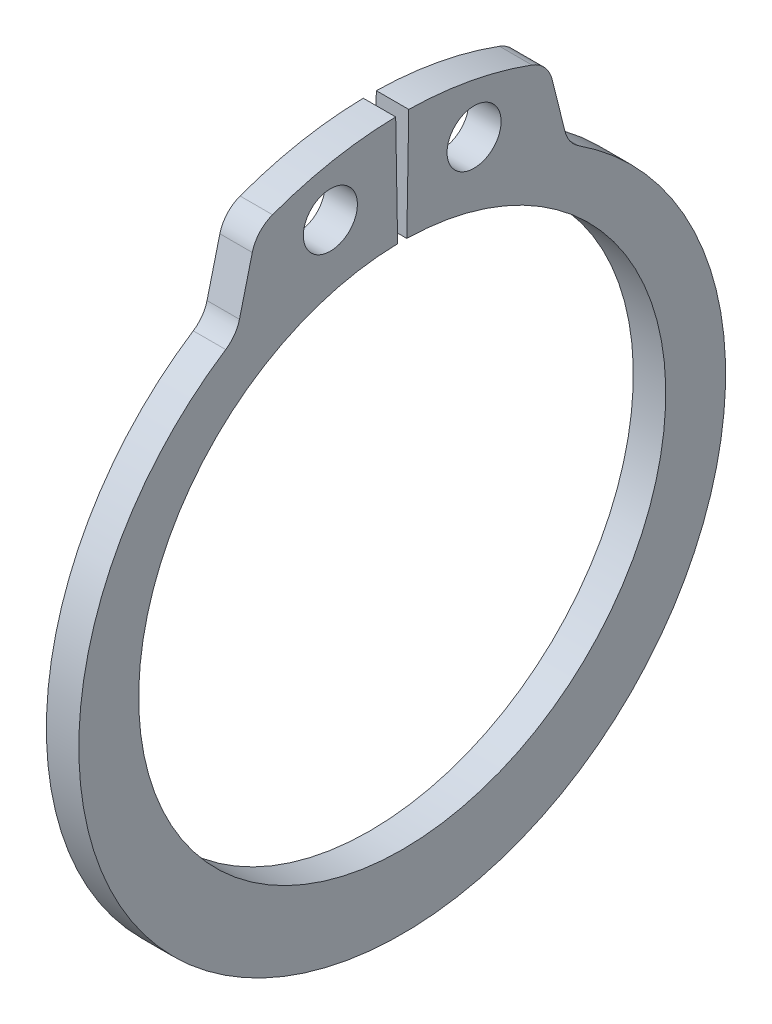
ISO-10303-21;
HEADER;
FILE_DESCRIPTION(('STEP AP214'),'2;1');
FILE_NAME('part.step','',(''),(''),'','','');
FILE_SCHEMA(('AUTOMOTIVE_DESIGN { 1 0 10303 214 1 1 1 1 }'));
ENDSEC;
DATA;
#1=APPLICATION_CONTEXT('core data for automotive mechanical design processes');
#2=APPLICATION_PROTOCOL_DEFINITION('international standard','automotive_design',2000,#1);
#3=PRODUCT_CONTEXT('',#1,'mechanical');
#4=PRODUCT('Part','Part','',(#3));
#5=PRODUCT_RELATED_PRODUCT_CATEGORY('part','',(#4));
#6=PRODUCT_DEFINITION_FORMATION('','',#4);
#7=PRODUCT_DEFINITION_CONTEXT('part definition',#1,'design');
#8=PRODUCT_DEFINITION('design','',#6,#7);
#9=PRODUCT_DEFINITION_SHAPE('','',#8);
#10=(LENGTH_UNIT() NAMED_UNIT(*) SI_UNIT(.MILLI.,.METRE.));
#11=(NAMED_UNIT(*) PLANE_ANGLE_UNIT() SI_UNIT($,.RADIAN.));
#12=(NAMED_UNIT(*) SI_UNIT($,.STERADIAN.) SOLID_ANGLE_UNIT());
#13=UNCERTAINTY_MEASURE_WITH_UNIT(LENGTH_MEASURE(1.E-05),#10,'distance_accuracy_value','');
#14=(GEOMETRIC_REPRESENTATION_CONTEXT(3) GLOBAL_UNCERTAINTY_ASSIGNED_CONTEXT((#13)) GLOBAL_UNIT_ASSIGNED_CONTEXT((#10,
#11,#12)) REPRESENTATION_CONTEXT('',''));
#15=CARTESIAN_POINT('',(0.,0.,0.));
#16=DIRECTION('',(0.,0.,1.));
#17=DIRECTION('',(1.,0.,0.));
#18=AXIS2_PLACEMENT_3D('',#15,#16,#17);
#19=CARTESIAN_POINT('',(0.6,10.5448233971455,7.18500975582168));
#20=DIRECTION('',(-1.,0.,0.));
#21=DIRECTION('',(0.,0.,1.));
#22=AXIS2_PLACEMENT_3D('',#19,#20,#21);
#23=CYLINDRICAL_SURFACE('',#22,1.2);
#24=CARTESIAN_POINT('',(-0.6,10.5448233971455,7.18500975582168));
#25=DIRECTION('',(1.,0.,0.));
#26=DIRECTION('',(0.,0.,-1.));
#27=AXIS2_PLACEMENT_3D('',#24,#25,#26);
#28=CIRCLE('',#27,1.2);
#29=CARTESIAN_POINT('',(-0.6,9.53932227271346,6.53005365899852));
#30=VERTEX_POINT('',#29);
#31=CARTESIAN_POINT('',(-0.6,10.2545171224259,6.02065488429048));
#32=VERTEX_POINT('',#31);
#33=EDGE_CURVE('E164',#30,#32,#28,.T.);
#34=ORIENTED_EDGE('',*,*,#33,.F.);
#35=DIRECTION('',(-1.,0.,0.));
#36=VECTOR('',#35,1.);
#37=CARTESIAN_POINT('',(0.6,9.53932227271346,6.53005365899852));
#38=LINE('',#37,#36);
#39=CARTESIAN_POINT('',(0.6,9.53932227271346,6.53005365899852));
#40=VERTEX_POINT('',#39);
#41=EDGE_CURVE('E11',#40,#30,#38,.T.);
#42=ORIENTED_EDGE('',*,*,#41,.F.);
#43=CARTESIAN_POINT('',(0.6,10.5448233971455,7.18500975582168));
#44=DIRECTION('',(1.,0.,0.));
#45=DIRECTION('',(0.,0.,-1.));
#46=AXIS2_PLACEMENT_3D('',#43,#44,#45);
#47=CIRCLE('',#46,1.2);
#48=CARTESIAN_POINT('',(0.6,10.2545171224259,6.02065488429048));
#49=VERTEX_POINT('',#48);
#50=EDGE_CURVE('E197',#40,#49,#47,.T.);
#51=ORIENTED_EDGE('',*,*,#50,.T.);
#52=DIRECTION('',(-1.,0.,0.));
#53=VECTOR('',#52,1.);
#54=CARTESIAN_POINT('',(0.6,10.2545171224259,6.02065488429048));
#55=LINE('',#54,#53);
#56=EDGE_CURVE('E46',#49,#32,#55,.T.);
#57=ORIENTED_EDGE('',*,*,#56,.T.);
#58=EDGE_LOOP('',(#34,#42,#51,#57));
#59=FACE_BOUND('',#58,.T.);
#60=ADVANCED_FACE('F43',(#59),#23,.F.);
#61=CARTESIAN_POINT('',(0.6,-0.485740977438435,0.));
#62=DIRECTION('',(-1.,0.,0.));
#63=DIRECTION('',(0.,0.,1.));
#64=AXIS2_PLACEMENT_3D('',#61,#62,#63);
#65=CYLINDRICAL_SURFACE('',#64,11.9642590225616);
#66=CARTESIAN_POINT('',(-0.6,-0.485740977438435,0.));
#67=DIRECTION('',(-1.,0.,0.));
#68=DIRECTION('',(0.,0.,1.));
#69=AXIS2_PLACEMENT_3D('',#66,#67,#68);
#70=CIRCLE('',#69,11.9642590225616);
#71=CARTESIAN_POINT('',(-0.6,9.53932227271346,-6.53005365899852));
#72=VERTEX_POINT('',#71);
#73=EDGE_CURVE('E195',#72,#30,#70,.T.);
#74=ORIENTED_EDGE('',*,*,#73,.F.);
#75=DIRECTION('',(-1.,0.,0.));
#76=VECTOR('',#75,1.);
#77=CARTESIAN_POINT('',(0.6,9.53932227271346,-6.53005365899852));
#78=LINE('',#77,#76);
#79=CARTESIAN_POINT('',(0.6,9.53932227271346,-6.53005365899852));
#80=VERTEX_POINT('',#79);
#81=EDGE_CURVE('E52',#80,#72,#78,.T.);
#82=ORIENTED_EDGE('',*,*,#81,.F.);
#83=CARTESIAN_POINT('',(0.6,-0.485740977438435,0.));
#84=DIRECTION('',(-1.,0.,0.));
#85=DIRECTION('',(0.,0.,1.));
#86=AXIS2_PLACEMENT_3D('',#83,#84,#85);
#87=CIRCLE('',#86,11.9642590225616);
#88=EDGE_CURVE('E154',#80,#40,#87,.T.);
#89=ORIENTED_EDGE('',*,*,#88,.T.);
#90=ORIENTED_EDGE('',*,*,#41,.T.);
#91=EDGE_LOOP('',(#74,#82,#89,#90));
#92=FACE_BOUND('',#91,.T.);
#93=ADVANCED_FACE('F217',(#92),#65,.T.);
#94=CARTESIAN_POINT('',(0.6,10.5448233971455,-7.18500975582168));
#95=DIRECTION('',(-1.,0.,0.));
#96=DIRECTION('',(0.,0.,1.));
#97=AXIS2_PLACEMENT_3D('',#94,#95,#96);
#98=CYLINDRICAL_SURFACE('',#97,1.2);
#99=CARTESIAN_POINT('',(-0.6,10.5448233971455,-7.18500975582168));
#100=DIRECTION('',(1.,0.,0.));
#101=DIRECTION('',(0.,0.,-1.));
#102=AXIS2_PLACEMENT_3D('',#99,#100,#101);
#103=CIRCLE('',#102,1.2);
#104=CARTESIAN_POINT('',(-0.6,10.2545171224259,-6.02065488429049));
#105=VERTEX_POINT('',#104);
#106=EDGE_CURVE('E141',#105,#72,#103,.T.);
#107=ORIENTED_EDGE('',*,*,#106,.F.);
#108=DIRECTION('',(-1.,0.,0.));
#109=VECTOR('',#108,1.);
#110=CARTESIAN_POINT('',(0.6,10.2545171224259,-6.02065488429049));
#111=LINE('',#110,#109);
#112=CARTESIAN_POINT('',(0.6,10.2545171224259,-6.02065488429049));
#113=VERTEX_POINT('',#112);
#114=EDGE_CURVE('E136',#113,#105,#111,.T.);
#115=ORIENTED_EDGE('',*,*,#114,.F.);
#116=CARTESIAN_POINT('',(0.6,10.5448233971455,-7.18500975582168));
#117=DIRECTION('',(1.,0.,0.));
#118=DIRECTION('',(0.,0.,-1.));
#119=AXIS2_PLACEMENT_3D('',#116,#117,#118);
#120=CIRCLE('',#119,1.2);
#121=EDGE_CURVE('E139',#113,#80,#120,.T.);
#122=ORIENTED_EDGE('',*,*,#121,.T.);
#123=ORIENTED_EDGE('',*,*,#81,.T.);
#124=EDGE_LOOP('',(#107,#115,#122,#123));
#125=FACE_BOUND('',#124,.T.);
#126=ADVANCED_FACE('F138',(#125),#98,.F.);
#127=CARTESIAN_POINT('',(0.6,12.1571172360104,-5.54628339776127));
#128=DIRECTION('',(0.,0.241921895599667,-0.970295726275997));
#129=DIRECTION('',(0.,0.970295726275997,0.241921895599667));
#130=AXIS2_PLACEMENT_3D('',#127,#128,#129);
#131=PLANE('',#130);
#132=DIRECTION('',(0.,-0.970295726275997,-0.241921895599667));
#133=VECTOR('',#132,1.);
#134=CARTESIAN_POINT('',(-0.6,12.1571172360104,-5.54628339776127));
#135=LINE('',#134,#133);
#136=CARTESIAN_POINT('',(-0.6,12.1571172360104,-5.54628339776127));
#137=VERTEX_POINT('',#136);
#138=EDGE_CURVE('E192',#137,#105,#135,.T.);
#139=ORIENTED_EDGE('',*,*,#138,.F.);
#140=DIRECTION('',(-1.,0.,0.));
#141=VECTOR('',#140,1.);
#142=CARTESIAN_POINT('',(0.6,12.1571172360104,-5.54628339776127));
#143=LINE('',#142,#141);
#144=CARTESIAN_POINT('',(0.6,12.1571172360104,-5.54628339776127));
#145=VERTEX_POINT('',#144);
#146=EDGE_CURVE('E146',#145,#137,#143,.T.);
#147=ORIENTED_EDGE('',*,*,#146,.F.);
#148=DIRECTION('',(0.,-0.970295726275997,-0.241921895599667));
#149=VECTOR('',#148,1.);
#150=CARTESIAN_POINT('',(0.6,12.1571172360104,-5.54628339776127));
#151=LINE('',#150,#149);
#152=EDGE_CURVE('E152',#145,#113,#151,.T.);
#153=ORIENTED_EDGE('',*,*,#152,.T.);
#154=ORIENTED_EDGE('',*,*,#114,.T.);
#155=EDGE_LOOP('',(#139,#147,#153,#154));
#156=FACE_BOUND('',#155,.T.);
#157=ADVANCED_FACE('F156',(#156),#131,.T.);
#158=CARTESIAN_POINT('',(0.6,11.8668109612908,-4.38192852623007));
#159=DIRECTION('',(-1.,0.,0.));
#160=DIRECTION('',(0.,0.,1.));
#161=AXIS2_PLACEMENT_3D('',#158,#159,#160);
#162=CYLINDRICAL_SURFACE('',#161,1.2);
#163=CARTESIAN_POINT('',(-0.6,11.8668109612908,-4.38192852623007));
#164=DIRECTION('',(-1.,0.,0.));
#165=DIRECTION('',(0.,0.,1.));
#166=AXIS2_PLACEMENT_3D('',#163,#164,#165);
#167=CIRCLE('',#166,1.2);
#168=CARTESIAN_POINT('',(-0.6,12.9925163489231,-4.79760554057601));
#169=VERTEX_POINT('',#168);
#170=EDGE_CURVE('E189',#169,#137,#167,.T.);
#171=ORIENTED_EDGE('',*,*,#170,.F.);
#172=DIRECTION('',(-1.,0.,0.));
#173=VECTOR('',#172,1.);
#174=CARTESIAN_POINT('',(0.6,12.9925163489231,-4.79760554057601));
#175=LINE('',#174,#173);
#176=CARTESIAN_POINT('',(0.6,12.9925163489231,-4.79760554057601));
#177=VERTEX_POINT('',#176);
#178=EDGE_CURVE('E201',#177,#169,#175,.T.);
#179=ORIENTED_EDGE('',*,*,#178,.F.);
#180=CARTESIAN_POINT('',(0.6,11.8668109612908,-4.38192852623007));
#181=DIRECTION('',(-1.,0.,0.));
#182=DIRECTION('',(0.,0.,1.));
#183=AXIS2_PLACEMENT_3D('',#180,#181,#182);
#184=CIRCLE('',#183,1.2);
#185=EDGE_CURVE('E157',#177,#145,#184,.T.);
#186=ORIENTED_EDGE('',*,*,#185,.T.);
#187=ORIENTED_EDGE('',*,*,#146,.T.);
#188=EDGE_LOOP('',(#171,#179,#186,#187));
#189=FACE_BOUND('',#188,.T.);
#190=ADVANCED_FACE('F230',(#189),#162,.T.);
#191=CARTESIAN_POINT('',(0.6,0.,0.));
#192=DIRECTION('',(-1.,0.,0.));
#193=DIRECTION('',(0.,0.,1.));
#194=AXIS2_PLACEMENT_3D('',#191,#192,#193);
#195=CYLINDRICAL_SURFACE('',#194,13.85);
#196=CARTESIAN_POINT('',(-0.6,0.,0.));
#197=DIRECTION('',(-1.,0.,0.));
#198=DIRECTION('',(0.,0.,1.));
#199=AXIS2_PLACEMENT_3D('',#196,#197,#198);
#200=CIRCLE('',#199,13.85);
#201=CARTESIAN_POINT('',(-0.6,13.847890577916,-0.24171582915638));
#202=VERTEX_POINT('',#201);
#203=EDGE_CURVE('E186',#202,#169,#200,.T.);
#204=ORIENTED_EDGE('',*,*,#203,.F.);
#205=DIRECTION('',(-1.,0.,0.));
#206=VECTOR('',#205,1.);
#207=CARTESIAN_POINT('',(0.6,13.847890577916,-0.24171582915638));
#208=LINE('',#207,#206);
#209=CARTESIAN_POINT('',(0.6,13.847890577916,-0.24171582915638));
#210=VERTEX_POINT('',#209);
#211=EDGE_CURVE('E203',#210,#202,#208,.T.);
#212=ORIENTED_EDGE('',*,*,#211,.F.);
#213=CARTESIAN_POINT('',(0.6,0.,0.));
#214=DIRECTION('',(-1.,0.,0.));
#215=DIRECTION('',(0.,0.,1.));
#216=AXIS2_PLACEMENT_3D('',#213,#214,#215);
#217=CIRCLE('',#216,13.85);
#218=EDGE_CURVE('E159',#210,#177,#217,.T.);
#219=ORIENTED_EDGE('',*,*,#218,.T.);
#220=ORIENTED_EDGE('',*,*,#178,.T.);
#221=EDGE_LOOP('',(#204,#212,#219,#220));
#222=FACE_BOUND('',#221,.T.);
#223=ADVANCED_FACE('F233',(#222),#195,.T.);
#224=CARTESIAN_POINT('',(0.6,9.74851502777481,-0.170160962763514));
#225=DIRECTION('',(0.,0.0174524064372841,0.999847695156391));
#226=DIRECTION('',(0.,-0.999847695156391,0.0174524064372841));
#227=AXIS2_PLACEMENT_3D('',#224,#225,#226);
#228=PLANE('',#227);
#229=DIRECTION('',(0.,0.999847695156391,-0.0174524064372841));
#230=VECTOR('',#229,1.);
#231=CARTESIAN_POINT('',(-0.6,9.74851502777481,-0.170160962763514));
#232=LINE('',#231,#230);
#233=CARTESIAN_POINT('',(-0.6,9.74851502777481,-0.170160962763515));
#234=VERTEX_POINT('',#233);
#235=EDGE_CURVE('E183',#234,#202,#232,.T.);
#236=ORIENTED_EDGE('',*,*,#235,.F.);
#237=DIRECTION('',(-1.,0.,0.));
#238=VECTOR('',#237,1.);
#239=CARTESIAN_POINT('',(0.6,9.74851502777481,-0.170160962763515));
#240=LINE('',#239,#238);
#241=CARTESIAN_POINT('',(0.6,9.74851502777481,-0.170160962763515));
#242=VERTEX_POINT('',#241);
#243=EDGE_CURVE('E205',#242,#234,#240,.T.);
#244=ORIENTED_EDGE('',*,*,#243,.F.);
#245=DIRECTION('',(0.,0.999847695156391,-0.0174524064372841));
#246=VECTOR('',#245,1.);
#247=CARTESIAN_POINT('',(0.6,9.74851502777481,-0.170160962763514));
#248=LINE('',#247,#246);
#249=EDGE_CURVE('E307',#242,#210,#248,.T.);
#250=ORIENTED_EDGE('',*,*,#249,.T.);
#251=ORIENTED_EDGE('',*,*,#211,.T.);
#252=EDGE_LOOP('',(#236,#244,#250,#251));
#253=FACE_BOUND('',#252,.T.);
#254=ADVANCED_FACE('F237',(#253),#228,.T.);
#255=CARTESIAN_POINT('',(0.6,0.,0.));
#256=DIRECTION('',(-1.,0.,0.));
#257=DIRECTION('',(0.,0.,1.));
#258=AXIS2_PLACEMENT_3D('',#255,#256,#257);
#259=CYLINDRICAL_SURFACE('',#258,9.75000000000002);
#260=CARTESIAN_POINT('',(-0.6,0.,0.));
#261=DIRECTION('',(1.,0.,0.));
#262=DIRECTION('',(0.,0.,-1.));
#263=AXIS2_PLACEMENT_3D('',#260,#261,#262);
#264=CIRCLE('',#263,9.75000000000002);
#265=CARTESIAN_POINT('',(-0.6,9.74851502777481,0.170160962763514));
#266=VERTEX_POINT('',#265);
#267=EDGE_CURVE('E180',#266,#234,#264,.T.);
#268=ORIENTED_EDGE('',*,*,#267,.F.);
#269=DIRECTION('',(-1.,0.,0.));
#270=VECTOR('',#269,1.);
#271=CARTESIAN_POINT('',(0.6,9.74851502777481,0.170160962763514));
#272=LINE('',#271,#270);
#273=CARTESIAN_POINT('',(0.6,9.74851502777481,0.170160962763514));
#274=VERTEX_POINT('',#273);
#275=EDGE_CURVE('E207',#274,#266,#272,.T.);
#276=ORIENTED_EDGE('',*,*,#275,.F.);
#277=CARTESIAN_POINT('',(0.6,0.,0.));
#278=DIRECTION('',(1.,0.,0.));
#279=DIRECTION('',(0.,0.,-1.));
#280=AXIS2_PLACEMENT_3D('',#277,#278,#279);
#281=CIRCLE('',#280,9.75000000000002);
#282=EDGE_CURVE('E304',#274,#242,#281,.T.);
#283=ORIENTED_EDGE('',*,*,#282,.T.);
#284=ORIENTED_EDGE('',*,*,#243,.T.);
#285=EDGE_LOOP('',(#268,#276,#283,#284));
#286=FACE_BOUND('',#285,.T.);
#287=ADVANCED_FACE('F241',(#286),#259,.F.);
#288=CARTESIAN_POINT('',(0.6,13.847890577916,0.241715829156377));
#289=DIRECTION('',(0.,0.0174524064372835,-0.999847695156391));
#290=DIRECTION('',(0.,0.999847695156391,0.0174524064372835));
#291=AXIS2_PLACEMENT_3D('',#288,#289,#290);
#292=PLANE('',#291);
#293=DIRECTION('',(0.,-0.999847695156391,-0.0174524064372835));
#294=VECTOR('',#293,1.);
#295=CARTESIAN_POINT('',(-0.6,13.847890577916,0.241715829156377));
#296=LINE('',#295,#294);
#297=CARTESIAN_POINT('',(-0.6,13.847890577916,0.241715829156376));
#298=VERTEX_POINT('',#297);
#299=EDGE_CURVE('E177',#298,#266,#296,.T.);
#300=ORIENTED_EDGE('',*,*,#299,.F.);
#301=DIRECTION('',(-1.,0.,0.));
#302=VECTOR('',#301,1.);
#303=CARTESIAN_POINT('',(0.6,13.847890577916,0.241715829156376));
#304=LINE('',#303,#302);
#305=CARTESIAN_POINT('',(0.6,13.847890577916,0.241715829156376));
#306=VERTEX_POINT('',#305);
#307=EDGE_CURVE('E209',#306,#298,#304,.T.);
#308=ORIENTED_EDGE('',*,*,#307,.F.);
#309=DIRECTION('',(0.,-0.999847695156391,-0.0174524064372835));
#310=VECTOR('',#309,1.);
#311=CARTESIAN_POINT('',(0.6,13.847890577916,0.241715829156377));
#312=LINE('',#311,#310);
#313=EDGE_CURVE('E301',#306,#274,#312,.T.);
#314=ORIENTED_EDGE('',*,*,#313,.T.);
#315=ORIENTED_EDGE('',*,*,#275,.T.);
#316=EDGE_LOOP('',(#300,#308,#314,#315));
#317=FACE_BOUND('',#316,.T.);
#318=ADVANCED_FACE('F245',(#317),#292,.T.);
#319=CARTESIAN_POINT('',(0.6,0.,0.));
#320=DIRECTION('',(-1.,0.,0.));
#321=DIRECTION('',(0.,0.,1.));
#322=AXIS2_PLACEMENT_3D('',#319,#320,#321);
#323=CYLINDRICAL_SURFACE('',#322,13.85);
#324=CARTESIAN_POINT('',(-0.6,0.,0.));
#325=DIRECTION('',(-1.,0.,0.));
#326=DIRECTION('',(0.,0.,1.));
#327=AXIS2_PLACEMENT_3D('',#324,#325,#326);
#328=CIRCLE('',#327,13.85);
#329=CARTESIAN_POINT('',(-0.6,12.9925163489231,4.79760554057601));
#330=VERTEX_POINT('',#329);
#331=EDGE_CURVE('E174',#330,#298,#328,.T.);
#332=ORIENTED_EDGE('',*,*,#331,.F.);
#333=DIRECTION('',(-1.,0.,0.));
#334=VECTOR('',#333,1.);
#335=CARTESIAN_POINT('',(0.6,12.9925163489231,4.79760554057601));
#336=LINE('',#335,#334);
#337=CARTESIAN_POINT('',(0.6,12.9925163489231,4.79760554057601));
#338=VERTEX_POINT('',#337);
#339=EDGE_CURVE('E211',#338,#330,#336,.T.);
#340=ORIENTED_EDGE('',*,*,#339,.F.);
#341=CARTESIAN_POINT('',(0.6,0.,0.));
#342=DIRECTION('',(-1.,0.,0.));
#343=DIRECTION('',(0.,0.,1.));
#344=AXIS2_PLACEMENT_3D('',#341,#342,#343);
#345=CIRCLE('',#344,13.85);
#346=EDGE_CURVE('E298',#338,#306,#345,.T.);
#347=ORIENTED_EDGE('',*,*,#346,.T.);
#348=ORIENTED_EDGE('',*,*,#307,.T.);
#349=EDGE_LOOP('',(#332,#340,#347,#348));
#350=FACE_BOUND('',#349,.T.);
#351=ADVANCED_FACE('F249',(#350),#323,.T.);
#352=CARTESIAN_POINT('',(0.6,11.8668109612908,4.38192852623007));
#353=DIRECTION('',(-1.,0.,0.));
#354=DIRECTION('',(0.,0.,1.));
#355=AXIS2_PLACEMENT_3D('',#352,#353,#354);
#356=CYLINDRICAL_SURFACE('',#355,1.2);
#357=CARTESIAN_POINT('',(-0.6,11.8668109612908,4.38192852623007));
#358=DIRECTION('',(-1.,0.,0.));
#359=DIRECTION('',(0.,0.,1.));
#360=AXIS2_PLACEMENT_3D('',#357,#358,#359);
#361=CIRCLE('',#360,1.2);
#362=CARTESIAN_POINT('',(-0.6,12.1571172360104,5.54628339776127));
#363=VERTEX_POINT('',#362);
#364=EDGE_CURVE('E171',#363,#330,#361,.T.);
#365=ORIENTED_EDGE('',*,*,#364,.F.);
#366=DIRECTION('',(-1.,0.,0.));
#367=VECTOR('',#366,1.);
#368=CARTESIAN_POINT('',(0.6,12.1571172360104,5.54628339776127));
#369=LINE('',#368,#367);
#370=CARTESIAN_POINT('',(0.6,12.1571172360104,5.54628339776127));
#371=VERTEX_POINT('',#370);
#372=EDGE_CURVE('E212',#371,#363,#369,.T.);
#373=ORIENTED_EDGE('',*,*,#372,.F.);
#374=CARTESIAN_POINT('',(0.6,11.8668109612908,4.38192852623007));
#375=DIRECTION('',(-1.,0.,0.));
#376=DIRECTION('',(0.,0.,1.));
#377=AXIS2_PLACEMENT_3D('',#374,#375,#376);
#378=CIRCLE('',#377,1.2);
#379=EDGE_CURVE('E295',#371,#338,#378,.T.);
#380=ORIENTED_EDGE('',*,*,#379,.T.);
#381=ORIENTED_EDGE('',*,*,#339,.T.);
#382=EDGE_LOOP('',(#365,#373,#380,#381));
#383=FACE_BOUND('',#382,.T.);
#384=ADVANCED_FACE('F253',(#383),#356,.T.);
#385=CARTESIAN_POINT('',(0.6,10.2545171224259,6.02065488429048));
#386=DIRECTION('',(0.,0.241921895599662,0.970295726275998));
#387=DIRECTION('',(0.,-0.970295726275998,0.241921895599662));
#388=AXIS2_PLACEMENT_3D('',#385,#386,#387);
#389=PLANE('',#388);
#390=DIRECTION('',(0.,0.970295726275998,-0.241921895599662));
#391=VECTOR('',#390,1.);
#392=CARTESIAN_POINT('',(-0.6,10.2545171224259,6.02065488429048));
#393=LINE('',#392,#391);
#394=EDGE_CURVE('E167',#32,#363,#393,.T.);
#395=ORIENTED_EDGE('',*,*,#394,.F.);
#396=ORIENTED_EDGE('',*,*,#56,.F.);
#397=DIRECTION('',(0.,0.970295726275998,-0.241921895599662));
#398=VECTOR('',#397,1.);
#399=CARTESIAN_POINT('',(0.6,10.2545171224259,6.02065488429048));
#400=LINE('',#399,#398);
#401=EDGE_CURVE('E293',#49,#371,#400,.T.);
#402=ORIENTED_EDGE('',*,*,#401,.T.);
#403=ORIENTED_EDGE('',*,*,#372,.T.);
#404=EDGE_LOOP('',(#395,#396,#402,#403));
#405=FACE_BOUND('',#404,.T.);
#406=ADVANCED_FACE('F214',(#405),#389,.T.);
#407=CARTESIAN_POINT('',(0.6,10.5448233971455,7.18500975582168));
#408=DIRECTION('',(1.,0.,0.));
#409=DIRECTION('',(0.,0.,-1.));
#410=AXIS2_PLACEMENT_3D('',#407,#408,#409);
#411=PLANE('',#410);
#412=CARTESIAN_POINT('',(0.6,11.7553998909786,2.65811557449511));
#413=DIRECTION('',(-1.,0.,0.));
#414=DIRECTION('',(0.,0.,-1.));
#415=AXIS2_PLACEMENT_3D('',#412,#413,#414);
#416=CIRCLE('',#415,1.);
#417=CARTESIAN_POINT('',(0.6,11.7553998909786,1.65811557449511));
#418=VERTEX_POINT('',#417);
#419=EDGE_CURVE('E280',#418,#418,#416,.T.);
#420=ORIENTED_EDGE('',*,*,#419,.T.);
#421=EDGE_LOOP('',(#420));
#422=FACE_BOUND('',#421,.T.);
#423=CARTESIAN_POINT('',(0.6,11.7553998909786,-2.65811557449511));
#424=DIRECTION('',(-1.,0.,0.));
#425=DIRECTION('',(0.,0.,-1.));
#426=AXIS2_PLACEMENT_3D('',#423,#424,#425);
#427=CIRCLE('',#426,1.);
#428=CARTESIAN_POINT('',(0.6,11.7553998909786,-3.65811557449511));
#429=VERTEX_POINT('',#428);
#430=EDGE_CURVE('E168',#429,#429,#427,.T.);
#431=ORIENTED_EDGE('',*,*,#430,.T.);
#432=EDGE_LOOP('',(#431));
#433=FACE_BOUND('',#432,.T.);
#434=ORIENTED_EDGE('',*,*,#50,.F.);
#435=ORIENTED_EDGE('',*,*,#88,.F.);
#436=ORIENTED_EDGE('',*,*,#121,.F.);
#437=ORIENTED_EDGE('',*,*,#152,.F.);
#438=ORIENTED_EDGE('',*,*,#185,.F.);
#439=ORIENTED_EDGE('',*,*,#218,.F.);
#440=ORIENTED_EDGE('',*,*,#249,.F.);
#441=ORIENTED_EDGE('',*,*,#282,.F.);
#442=ORIENTED_EDGE('',*,*,#313,.F.);
#443=ORIENTED_EDGE('',*,*,#346,.F.);
#444=ORIENTED_EDGE('',*,*,#379,.F.);
#445=ORIENTED_EDGE('',*,*,#401,.F.);
#446=EDGE_LOOP('',(#434,#435,#436,#437,#438,#439,#440,#441,#442,#443,#444,#445));
#447=FACE_BOUND('',#446,.T.);
#448=ADVANCED_FACE('F150',(#422,#433,#447),#411,.T.);
#449=CARTESIAN_POINT('',(-0.6,10.5448233971455,7.18500975582168));
#450=DIRECTION('',(1.,0.,0.));
#451=DIRECTION('',(0.,0.,-1.));
#452=AXIS2_PLACEMENT_3D('',#449,#450,#451);
#453=PLANE('',#452);
#454=CARTESIAN_POINT('',(-0.6,11.7553998909786,2.65811557449511));
#455=DIRECTION('',(-1.,0.,0.));
#456=DIRECTION('',(0.,0.,-1.));
#457=AXIS2_PLACEMENT_3D('',#454,#455,#456);
#458=CIRCLE('',#457,1.);
#459=CARTESIAN_POINT('',(-0.6,11.7553998909786,1.65811557449511));
#460=VERTEX_POINT('',#459);
#461=EDGE_CURVE('E283',#460,#460,#458,.T.);
#462=ORIENTED_EDGE('',*,*,#461,.F.);
#463=EDGE_LOOP('',(#462));
#464=FACE_BOUND('',#463,.T.);
#465=CARTESIAN_POINT('',(-0.6,11.7553998909786,-2.65811557449511));
#466=DIRECTION('',(-1.,0.,0.));
#467=DIRECTION('',(0.,0.,-1.));
#468=AXIS2_PLACEMENT_3D('',#465,#466,#467);
#469=CIRCLE('',#468,1.);
#470=CARTESIAN_POINT('',(-0.6,11.7553998909786,-3.65811557449511));
#471=VERTEX_POINT('',#470);
#472=EDGE_CURVE('E285',#471,#471,#469,.T.);
#473=ORIENTED_EDGE('',*,*,#472,.F.);
#474=EDGE_LOOP('',(#473));
#475=FACE_BOUND('',#474,.T.);
#476=ORIENTED_EDGE('',*,*,#33,.T.);
#477=ORIENTED_EDGE('',*,*,#394,.T.);
#478=ORIENTED_EDGE('',*,*,#364,.T.);
#479=ORIENTED_EDGE('',*,*,#331,.T.);
#480=ORIENTED_EDGE('',*,*,#299,.T.);
#481=ORIENTED_EDGE('',*,*,#267,.T.);
#482=ORIENTED_EDGE('',*,*,#235,.T.);
#483=ORIENTED_EDGE('',*,*,#203,.T.);
#484=ORIENTED_EDGE('',*,*,#170,.T.);
#485=ORIENTED_EDGE('',*,*,#138,.T.);
#486=ORIENTED_EDGE('',*,*,#106,.T.);
#487=ORIENTED_EDGE('',*,*,#73,.T.);
#488=EDGE_LOOP('',(#476,#477,#478,#479,#480,#481,#482,#483,#484,#485,#486,#487));
#489=FACE_BOUND('',#488,.T.);
#490=ADVANCED_FACE('F216',(#464,#475,#489),#453,.F.);
#491=CARTESIAN_POINT('',(0.6,11.7553998909786,-2.65811557449511));
#492=DIRECTION('',(-1.,0.,0.));
#493=DIRECTION('',(0.,0.,1.));
#494=AXIS2_PLACEMENT_3D('',#491,#492,#493);
#495=CYLINDRICAL_SURFACE('',#494,1.);
#496=ORIENTED_EDGE('',*,*,#430,.F.);
#497=EDGE_LOOP('',(#496));
#498=FACE_BOUND('',#497,.T.);
#499=ORIENTED_EDGE('',*,*,#472,.T.);
#500=EDGE_LOOP('',(#499));
#501=FACE_BOUND('',#500,.T.);
#502=ADVANCED_FACE('F265',(#498,#501),#495,.F.);
#503=CARTESIAN_POINT('',(0.6,11.7553998909786,2.65811557449511));
#504=DIRECTION('',(-1.,0.,0.));
#505=DIRECTION('',(0.,0.,1.));
#506=AXIS2_PLACEMENT_3D('',#503,#504,#505);
#507=CYLINDRICAL_SURFACE('',#506,1.);
#508=ORIENTED_EDGE('',*,*,#419,.F.);
#509=EDGE_LOOP('',(#508));
#510=FACE_BOUND('',#509,.T.);
#511=ORIENTED_EDGE('',*,*,#461,.T.);
#512=EDGE_LOOP('',(#511));
#513=FACE_BOUND('',#512,.T.);
#514=ADVANCED_FACE('F272',(#510,#513),#507,.F.);
#515=CLOSED_SHELL('',(#60,#93,#126,#157,#190,#223,#254,#287,#318,#351,#384,#406,#448,#490,#502,#514));
#516=MANIFOLD_SOLID_BREP('B2',#515);
#517=ADVANCED_BREP_SHAPE_REPRESENTATION('',(#18,#516),#14);
#518=SHAPE_DEFINITION_REPRESENTATION(#9,#517);
ENDSEC;
END-ISO-10303-21;
